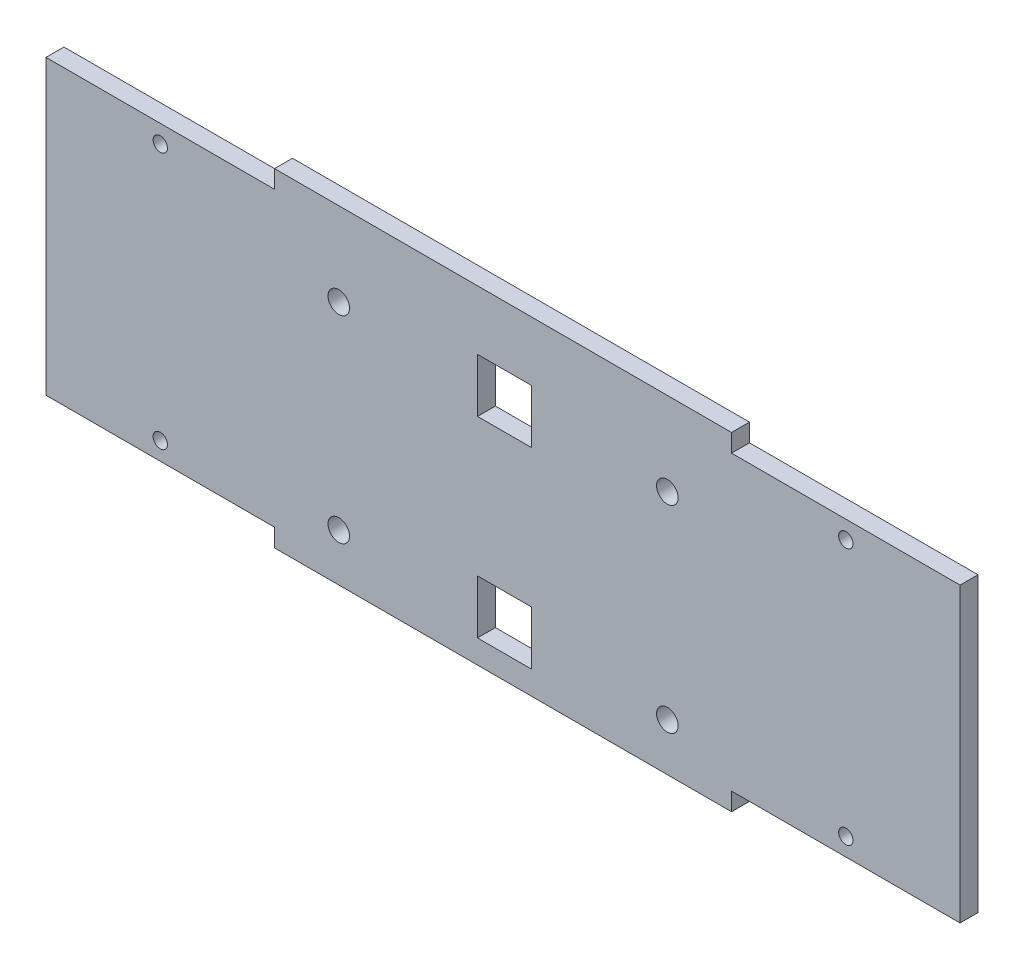
ISO-10303-21;
HEADER;
FILE_DESCRIPTION(('STEP AP214'),'2;1');
FILE_NAME('part.step','',(''),(''),'','','');
FILE_SCHEMA(('AUTOMOTIVE_DESIGN { 1 0 10303 214 1 1 1 1 }'));
ENDSEC;
DATA;
#1=APPLICATION_CONTEXT('core data for automotive mechanical design processes');
#2=APPLICATION_PROTOCOL_DEFINITION('international standard','automotive_design',2000,#1);
#3=PRODUCT_CONTEXT('',#1,'mechanical');
#4=PRODUCT('Part','Part','',(#3));
#5=PRODUCT_RELATED_PRODUCT_CATEGORY('part','',(#4));
#6=PRODUCT_DEFINITION_FORMATION('','',#4);
#7=PRODUCT_DEFINITION_CONTEXT('part definition',#1,'design');
#8=PRODUCT_DEFINITION('design','',#6,#7);
#9=PRODUCT_DEFINITION_SHAPE('','',#8);
#10=(LENGTH_UNIT() NAMED_UNIT(*) SI_UNIT(.MILLI.,.METRE.));
#11=(NAMED_UNIT(*) PLANE_ANGLE_UNIT() SI_UNIT($,.RADIAN.));
#12=(NAMED_UNIT(*) SI_UNIT($,.STERADIAN.) SOLID_ANGLE_UNIT());
#13=UNCERTAINTY_MEASURE_WITH_UNIT(LENGTH_MEASURE(1.E-05),#10,'distance_accuracy_value','');
#14=(GEOMETRIC_REPRESENTATION_CONTEXT(3) GLOBAL_UNCERTAINTY_ASSIGNED_CONTEXT((#13)) GLOBAL_UNIT_ASSIGNED_CONTEXT((#10,
#11,#12)) REPRESENTATION_CONTEXT('',''));
#15=CARTESIAN_POINT('',(0.,0.,0.));
#16=DIRECTION('',(0.,0.,1.));
#17=DIRECTION('',(1.,0.,0.));
#18=AXIS2_PLACEMENT_3D('',#15,#16,#17);
#19=CARTESIAN_POINT('',(63.75,0.,5.));
#20=DIRECTION('',(-1.,0.,0.));
#21=DIRECTION('',(0.,0.,1.));
#22=AXIS2_PLACEMENT_3D('',#19,#20,#21);
#23=PLANE('',#22);
#24=DIRECTION('',(0.,1.,0.));
#25=VECTOR('',#24,1.);
#26=CARTESIAN_POINT('',(63.75,0.,0.));
#27=LINE('',#26,#25);
#28=CARTESIAN_POINT('',(63.75,81.6376455792225,0.));
#29=VERTEX_POINT('',#28);
#30=CARTESIAN_POINT('',(63.75,86.6376455792225,0.));
#31=VERTEX_POINT('',#30);
#32=EDGE_CURVE('E205',#29,#31,#27,.T.);
#33=ORIENTED_EDGE('',*,*,#32,.F.);
#34=DIRECTION('',(0.,0.,-1.));
#35=VECTOR('',#34,1.);
#36=CARTESIAN_POINT('',(63.75,81.6376455792225,0.));
#37=LINE('',#36,#35);
#38=CARTESIAN_POINT('',(63.75,81.6376455792225,5.));
#39=VERTEX_POINT('',#38);
#40=EDGE_CURVE('E428',#39,#29,#37,.T.);
#41=ORIENTED_EDGE('',*,*,#40,.F.);
#42=DIRECTION('',(0.,1.,0.));
#43=VECTOR('',#42,1.);
#44=CARTESIAN_POINT('',(63.75,0.,5.));
#45=LINE('',#44,#43);
#46=CARTESIAN_POINT('',(63.75,86.6376455792225,5.));
#47=VERTEX_POINT('',#46);
#48=EDGE_CURVE('E398',#39,#47,#45,.T.);
#49=ORIENTED_EDGE('',*,*,#48,.T.);
#50=DIRECTION('',(0.,0.,1.));
#51=VECTOR('',#50,1.);
#52=CARTESIAN_POINT('',(63.75,86.6376455792225,0.));
#53=LINE('',#52,#51);
#54=EDGE_CURVE('E437',#31,#47,#53,.T.);
#55=ORIENTED_EDGE('',*,*,#54,.F.);
#56=EDGE_LOOP('',(#33,#41,#49,#55));
#57=FACE_BOUND('',#56,.T.);
#58=ADVANCED_FACE('F35',(#57),#23,.T.);
#59=CARTESIAN_POINT('',(0.,0.,5.));
#60=DIRECTION('',(0.,0.,1.));
#61=DIRECTION('',(1.,0.,0.));
#62=AXIS2_PLACEMENT_3D('',#59,#60,#61);
#63=PLANE('',#62);
#64=CARTESIAN_POINT('',(223.125,76.6376455792225,5.));
#65=DIRECTION('',(0.,0.,1.));
#66=DIRECTION('',(1.,0.,0.));
#67=AXIS2_PLACEMENT_3D('',#64,#65,#66);
#68=CIRCLE('',#67,2.);
#69=CARTESIAN_POINT('',(225.125,76.6376455792225,5.));
#70=VERTEX_POINT('',#69);
#71=EDGE_CURVE('E534',#70,#70,#68,.T.);
#72=ORIENTED_EDGE('',*,*,#71,.F.);
#73=EDGE_LOOP('',(#72));
#74=FACE_BOUND('',#73,.T.);
#75=CARTESIAN_POINT('',(31.875,76.6376455792225,5.));
#76=DIRECTION('',(0.,0.,1.));
#77=DIRECTION('',(1.,0.,0.));
#78=AXIS2_PLACEMENT_3D('',#75,#76,#77);
#79=CIRCLE('',#78,2.);
#80=CARTESIAN_POINT('',(33.875,76.6376455792225,5.));
#81=VERTEX_POINT('',#80);
#82=EDGE_CURVE('E537',#81,#81,#79,.T.);
#83=ORIENTED_EDGE('',*,*,#82,.F.);
#84=EDGE_LOOP('',(#83));
#85=FACE_BOUND('',#84,.T.);
#86=ORIENTED_EDGE('',*,*,#48,.F.);
#87=DIRECTION('',(1.,0.,0.));
#88=VECTOR('',#87,1.);
#89=CARTESIAN_POINT('',(63.75,81.6376455792225,5.));
#90=LINE('',#89,#88);
#91=CARTESIAN_POINT('',(0.,81.6376455792225,5.));
#92=VERTEX_POINT('',#91);
#93=EDGE_CURVE('E412',#92,#39,#90,.T.);
#94=ORIENTED_EDGE('',*,*,#93,.F.);
#95=DIRECTION('',(0.,1.,0.));
#96=VECTOR('',#95,1.);
#97=CARTESIAN_POINT('',(0.,0.,5.));
#98=LINE('',#97,#96);
#99=CARTESIAN_POINT('',(0.,0.,5.));
#100=VERTEX_POINT('',#99);
#101=EDGE_CURVE('E401',#100,#92,#98,.T.);
#102=ORIENTED_EDGE('',*,*,#101,.F.);
#103=DIRECTION('',(1.,0.,0.));
#104=VECTOR('',#103,1.);
#105=CARTESIAN_POINT('',(0.,0.,5.));
#106=LINE('',#105,#104);
#107=CARTESIAN_POINT('',(63.75,0.,5.));
#108=VERTEX_POINT('',#107);
#109=EDGE_CURVE('E404',#100,#108,#106,.T.);
#110=ORIENTED_EDGE('',*,*,#109,.T.);
#111=DIRECTION('',(0.,-1.,0.));
#112=VECTOR('',#111,1.);
#113=CARTESIAN_POINT('',(63.75,0.,5.));
#114=LINE('',#113,#112);
#115=CARTESIAN_POINT('',(63.75,-5.,5.));
#116=VERTEX_POINT('',#115);
#117=EDGE_CURVE('E376',#108,#116,#114,.T.);
#118=ORIENTED_EDGE('',*,*,#117,.T.);
#119=DIRECTION('',(1.,0.,0.));
#120=VECTOR('',#119,1.);
#121=CARTESIAN_POINT('',(0.,-5.,5.));
#122=LINE('',#121,#120);
#123=CARTESIAN_POINT('',(191.25,-5.,5.));
#124=VERTEX_POINT('',#123);
#125=EDGE_CURVE('E384',#116,#124,#122,.T.);
#126=ORIENTED_EDGE('',*,*,#125,.T.);
#127=DIRECTION('',(0.,1.,0.));
#128=VECTOR('',#127,1.);
#129=CARTESIAN_POINT('',(191.25,0.,5.));
#130=LINE('',#129,#128);
#131=CARTESIAN_POINT('',(191.25,0.,5.));
#132=VERTEX_POINT('',#131);
#133=EDGE_CURVE('E386',#124,#132,#130,.T.);
#134=ORIENTED_EDGE('',*,*,#133,.T.);
#135=DIRECTION('',(1.,0.,0.));
#136=VECTOR('',#135,1.);
#137=CARTESIAN_POINT('',(0.,0.,5.));
#138=LINE('',#137,#136);
#139=CARTESIAN_POINT('',(255.,0.,5.));
#140=VERTEX_POINT('',#139);
#141=EDGE_CURVE('E388',#132,#140,#138,.T.);
#142=ORIENTED_EDGE('',*,*,#141,.T.);
#143=DIRECTION('',(0.,1.,0.));
#144=VECTOR('',#143,1.);
#145=CARTESIAN_POINT('',(255.,0.,5.));
#146=LINE('',#145,#144);
#147=CARTESIAN_POINT('',(255.,81.6376455792225,5.));
#148=VERTEX_POINT('',#147);
#149=EDGE_CURVE('E395',#140,#148,#146,.T.);
#150=ORIENTED_EDGE('',*,*,#149,.T.);
#151=DIRECTION('',(1.,0.,0.));
#152=VECTOR('',#151,1.);
#153=CARTESIAN_POINT('',(255.,81.6376455792225,5.));
#154=LINE('',#153,#152);
#155=CARTESIAN_POINT('',(191.25,81.6376455792225,5.));
#156=VERTEX_POINT('',#155);
#157=EDGE_CURVE('E458',#156,#148,#154,.T.);
#158=ORIENTED_EDGE('',*,*,#157,.F.);
#159=DIRECTION('',(0.,-1.,0.));
#160=VECTOR('',#159,1.);
#161=CARTESIAN_POINT('',(191.25,86.6376455792225,5.));
#162=LINE('',#161,#160);
#163=CARTESIAN_POINT('',(191.25,86.6376455792225,5.));
#164=VERTEX_POINT('',#163);
#165=EDGE_CURVE('E443',#164,#156,#162,.T.);
#166=ORIENTED_EDGE('',*,*,#165,.F.);
#167=DIRECTION('',(1.,0.,0.));
#168=VECTOR('',#167,1.);
#169=CARTESIAN_POINT('',(191.25,86.6376455792225,5.));
#170=LINE('',#169,#168);
#171=EDGE_CURVE('E440',#47,#164,#170,.T.);
#172=ORIENTED_EDGE('',*,*,#171,.F.);
#173=EDGE_LOOP('',(#86,#94,#102,#110,#118,#126,#134,#142,#150,#158,#166,#172));
#174=FACE_BOUND('',#173,.T.);
#175=CARTESIAN_POINT('',(223.125,4.99999999999999,5.));
#176=DIRECTION('',(0.,0.,1.));
#177=DIRECTION('',(1.,0.,0.));
#178=AXIS2_PLACEMENT_3D('',#175,#176,#177);
#179=CIRCLE('',#178,2.);
#180=CARTESIAN_POINT('',(225.125,4.99999999999999,5.));
#181=VERTEX_POINT('',#180);
#182=EDGE_CURVE('E174',#181,#181,#179,.T.);
#183=ORIENTED_EDGE('',*,*,#182,.F.);
#184=EDGE_LOOP('',(#183));
#185=FACE_BOUND('',#184,.T.);
#186=CARTESIAN_POINT('',(31.875,4.99999999999999,5.));
#187=DIRECTION('',(0.,0.,1.));
#188=DIRECTION('',(1.,0.,0.));
#189=AXIS2_PLACEMENT_3D('',#186,#187,#188);
#190=CIRCLE('',#189,2.);
#191=CARTESIAN_POINT('',(33.875,4.99999999999999,5.));
#192=VERTEX_POINT('',#191);
#193=EDGE_CURVE('E467',#192,#192,#190,.T.);
#194=ORIENTED_EDGE('',*,*,#193,.F.);
#195=EDGE_LOOP('',(#194));
#196=FACE_BOUND('',#195,.T.);
#197=CARTESIAN_POINT('',(173.3315727,8.27911762961123,5.));
#198=DIRECTION('',(0.,0.,1.));
#199=DIRECTION('',(1.,0.,0.));
#200=AXIS2_PLACEMENT_3D('',#197,#198,#199);
#201=CIRCLE('',#200,2.99999999999999);
#202=CARTESIAN_POINT('',(176.3315727,8.27911762961123,5.));
#203=VERTEX_POINT('',#202);
#204=EDGE_CURVE('E223',#203,#203,#201,.T.);
#205=ORIENTED_EDGE('',*,*,#204,.F.);
#206=EDGE_LOOP('',(#205));
#207=FACE_BOUND('',#206,.T.);
#208=CARTESIAN_POINT('',(81.6684273,8.27911762961123,5.));
#209=DIRECTION('',(0.,0.,1.));
#210=DIRECTION('',(1.,0.,0.));
#211=AXIS2_PLACEMENT_3D('',#208,#209,#210);
#212=CIRCLE('',#211,3.00000000000001);
#213=CARTESIAN_POINT('',(84.6684273,8.27911762961123,5.));
#214=VERTEX_POINT('',#213);
#215=EDGE_CURVE('E335',#214,#214,#212,.T.);
#216=ORIENTED_EDGE('',*,*,#215,.F.);
#217=EDGE_LOOP('',(#216));
#218=FACE_BOUND('',#217,.T.);
#219=CARTESIAN_POINT('',(173.3315727,63.3585279496113,5.));
#220=DIRECTION('',(0.,0.,1.));
#221=DIRECTION('',(1.,0.,0.));
#222=AXIS2_PLACEMENT_3D('',#219,#220,#221);
#223=CIRCLE('',#222,2.99999999999999);
#224=CARTESIAN_POINT('',(176.3315727,63.3585279496113,5.));
#225=VERTEX_POINT('',#224);
#226=EDGE_CURVE('E475',#225,#225,#223,.T.);
#227=ORIENTED_EDGE('',*,*,#226,.F.);
#228=EDGE_LOOP('',(#227));
#229=FACE_BOUND('',#228,.T.);
#230=CARTESIAN_POINT('',(81.6684273,63.3585279496113,5.));
#231=DIRECTION('',(0.,0.,1.));
#232=DIRECTION('',(1.,0.,0.));
#233=AXIS2_PLACEMENT_3D('',#230,#231,#232);
#234=CIRCLE('',#233,3.00000000000001);
#235=CARTESIAN_POINT('',(84.6684273,63.3585279496113,5.));
#236=VERTEX_POINT('',#235);
#237=EDGE_CURVE('E478',#236,#236,#234,.T.);
#238=ORIENTED_EDGE('',*,*,#237,.F.);
#239=EDGE_LOOP('',(#238));
#240=FACE_BOUND('',#239,.T.);
#241=DIRECTION('',(-1.,0.,0.));
#242=VECTOR('',#241,1.);
#243=CARTESIAN_POINT('',(0.,16.5582352592225,5.));
#244=LINE('',#243,#242);
#245=CARTESIAN_POINT('',(135.370410972912,16.5582352592223,5.));
#246=VERTEX_POINT('',#245);
#247=CARTESIAN_POINT('',(120.370410972912,16.5582352592223,5.));
#248=VERTEX_POINT('',#247);
#249=EDGE_CURVE('E260',#246,#248,#244,.T.);
#250=ORIENTED_EDGE('',*,*,#249,.F.);
#251=DIRECTION('',(0.,-1.,0.));
#252=VECTOR('',#251,1.);
#253=CARTESIAN_POINT('',(135.370410972912,0.,5.));
#254=LINE('',#253,#252);
#255=CARTESIAN_POINT('',(135.370410972912,1.5582352592223,5.));
#256=VERTEX_POINT('',#255);
#257=EDGE_CURVE('E253',#246,#256,#254,.T.);
#258=ORIENTED_EDGE('',*,*,#257,.T.);
#259=DIRECTION('',(-1.,0.,0.));
#260=VECTOR('',#259,1.);
#261=CARTESIAN_POINT('',(0.,1.55823525922255,5.));
#262=LINE('',#261,#260);
#263=CARTESIAN_POINT('',(120.370410972912,1.55823525922233,5.));
#264=VERTEX_POINT('',#263);
#265=EDGE_CURVE('E390',#256,#264,#262,.T.);
#266=ORIENTED_EDGE('',*,*,#265,.T.);
#267=DIRECTION('',(0.,-1.,0.));
#268=VECTOR('',#267,1.);
#269=CARTESIAN_POINT('',(120.370410972912,-2.22730002909532E-13,5.));
#270=LINE('',#269,#268);
#271=EDGE_CURVE('E265',#248,#264,#270,.T.);
#272=ORIENTED_EDGE('',*,*,#271,.F.);
#273=EDGE_LOOP('',(#250,#258,#266,#272));
#274=FACE_BOUND('',#273,.T.);
#275=DIRECTION('',(-1.,0.,0.));
#276=VECTOR('',#275,1.);
#277=CARTESIAN_POINT('',(0.,55.07941032,5.));
#278=LINE('',#277,#276);
#279=CARTESIAN_POINT('',(135.370410972912,55.07941032,5.));
#280=VERTEX_POINT('',#279);
#281=CARTESIAN_POINT('',(120.370410972912,55.07941032,5.));
#282=VERTEX_POINT('',#281);
#283=EDGE_CURVE('E153',#280,#282,#278,.T.);
#284=ORIENTED_EDGE('',*,*,#283,.T.);
#285=DIRECTION('',(0.,1.,0.));
#286=VECTOR('',#285,1.);
#287=CARTESIAN_POINT('',(120.370410972912,0.,5.));
#288=LINE('',#287,#286);
#289=CARTESIAN_POINT('',(120.370410972912,70.07941032,5.));
#290=VERTEX_POINT('',#289);
#291=EDGE_CURVE('E147',#282,#290,#288,.T.);
#292=ORIENTED_EDGE('',*,*,#291,.T.);
#293=DIRECTION('',(-1.,0.,0.));
#294=VECTOR('',#293,1.);
#295=CARTESIAN_POINT('',(0.,70.07941032,5.));
#296=LINE('',#295,#294);
#297=CARTESIAN_POINT('',(135.370410972912,70.07941032,5.));
#298=VERTEX_POINT('',#297);
#299=EDGE_CURVE('E152',#298,#290,#296,.T.);
#300=ORIENTED_EDGE('',*,*,#299,.F.);
#301=DIRECTION('',(0.,1.,0.));
#302=VECTOR('',#301,1.);
#303=CARTESIAN_POINT('',(135.370410972912,0.,5.));
#304=LINE('',#303,#302);
#305=EDGE_CURVE('E164',#280,#298,#304,.T.);
#306=ORIENTED_EDGE('',*,*,#305,.F.);
#307=EDGE_LOOP('',(#284,#292,#300,#306));
#308=FACE_BOUND('',#307,.T.);
#309=ADVANCED_FACE('F149',(#74,#85,#174,#185,#196,#207,#218,#229,#240,#274,#308),#63,.T.);
#310=CARTESIAN_POINT('',(0.,0.,0.));
#311=DIRECTION('',(0.,0.,1.));
#312=DIRECTION('',(1.,0.,0.));
#313=AXIS2_PLACEMENT_3D('',#310,#311,#312);
#314=PLANE('',#313);
#315=CARTESIAN_POINT('',(223.125,76.6376455792225,0.));
#316=DIRECTION('',(0.,0.,-1.));
#317=DIRECTION('',(-1.,0.,0.));
#318=AXIS2_PLACEMENT_3D('',#315,#316,#317);
#319=CIRCLE('',#318,2.);
#320=CARTESIAN_POINT('',(221.125,76.6376455792225,0.));
#321=VERTEX_POINT('',#320);
#322=EDGE_CURVE('E536',#321,#321,#319,.T.);
#323=ORIENTED_EDGE('',*,*,#322,.F.);
#324=EDGE_LOOP('',(#323));
#325=FACE_BOUND('',#324,.T.);
#326=CARTESIAN_POINT('',(31.875,76.6376455792225,0.));
#327=DIRECTION('',(0.,0.,-1.));
#328=DIRECTION('',(-1.,0.,0.));
#329=AXIS2_PLACEMENT_3D('',#326,#327,#328);
#330=CIRCLE('',#329,2.);
#331=CARTESIAN_POINT('',(29.875,76.6376455792225,0.));
#332=VERTEX_POINT('',#331);
#333=EDGE_CURVE('E538',#332,#332,#330,.T.);
#334=ORIENTED_EDGE('',*,*,#333,.F.);
#335=EDGE_LOOP('',(#334));
#336=FACE_BOUND('',#335,.T.);
#337=DIRECTION('',(-1.,0.,0.));
#338=VECTOR('',#337,1.);
#339=CARTESIAN_POINT('',(63.75,81.6376455792225,0.));
#340=LINE('',#339,#338);
#341=CARTESIAN_POINT('',(0.,81.6376455792225,0.));
#342=VERTEX_POINT('',#341);
#343=EDGE_CURVE('E424',#29,#342,#340,.T.);
#344=ORIENTED_EDGE('',*,*,#343,.F.);
#345=ORIENTED_EDGE('',*,*,#32,.T.);
#346=DIRECTION('',(-1.,0.,0.));
#347=VECTOR('',#346,1.);
#348=CARTESIAN_POINT('',(191.25,86.6376455792225,0.));
#349=LINE('',#348,#347);
#350=CARTESIAN_POINT('',(191.25,86.6376455792225,0.));
#351=VERTEX_POINT('',#350);
#352=EDGE_CURVE('E434',#351,#31,#349,.T.);
#353=ORIENTED_EDGE('',*,*,#352,.F.);
#354=DIRECTION('',(0.,-1.,0.));
#355=VECTOR('',#354,1.);
#356=CARTESIAN_POINT('',(191.25,86.6376455792225,0.));
#357=LINE('',#356,#355);
#358=CARTESIAN_POINT('',(191.25,81.6376455792225,0.));
#359=VERTEX_POINT('',#358);
#360=EDGE_CURVE('E446',#351,#359,#357,.T.);
#361=ORIENTED_EDGE('',*,*,#360,.T.);
#362=DIRECTION('',(-1.,0.,0.));
#363=VECTOR('',#362,1.);
#364=CARTESIAN_POINT('',(255.,81.6376455792225,0.));
#365=LINE('',#364,#363);
#366=CARTESIAN_POINT('',(255.,81.6376455792225,0.));
#367=VERTEX_POINT('',#366);
#368=EDGE_CURVE('E452',#367,#359,#365,.T.);
#369=ORIENTED_EDGE('',*,*,#368,.F.);
#370=DIRECTION('',(0.,1.,0.));
#371=VECTOR('',#370,1.);
#372=CARTESIAN_POINT('',(255.,0.,0.));
#373=LINE('',#372,#371);
#374=CARTESIAN_POINT('',(255.,0.,0.));
#375=VERTEX_POINT('',#374);
#376=EDGE_CURVE('E202',#375,#367,#373,.T.);
#377=ORIENTED_EDGE('',*,*,#376,.F.);
#378=DIRECTION('',(1.,0.,0.));
#379=VECTOR('',#378,1.);
#380=CARTESIAN_POINT('',(0.,0.,0.));
#381=LINE('',#380,#379);
#382=CARTESIAN_POINT('',(191.25,0.,0.));
#383=VERTEX_POINT('',#382);
#384=EDGE_CURVE('E200',#383,#375,#381,.T.);
#385=ORIENTED_EDGE('',*,*,#384,.F.);
#386=DIRECTION('',(0.,1.,0.));
#387=VECTOR('',#386,1.);
#388=CARTESIAN_POINT('',(191.25,0.,0.));
#389=LINE('',#388,#387);
#390=CARTESIAN_POINT('',(191.25,-5.,0.));
#391=VERTEX_POINT('',#390);
#392=EDGE_CURVE('E198',#391,#383,#389,.T.);
#393=ORIENTED_EDGE('',*,*,#392,.F.);
#394=DIRECTION('',(1.,0.,0.));
#395=VECTOR('',#394,1.);
#396=CARTESIAN_POINT('',(0.,-5.,0.));
#397=LINE('',#396,#395);
#398=CARTESIAN_POINT('',(63.75,-5.,0.));
#399=VERTEX_POINT('',#398);
#400=EDGE_CURVE('E195',#399,#391,#397,.T.);
#401=ORIENTED_EDGE('',*,*,#400,.F.);
#402=DIRECTION('',(0.,-1.,0.));
#403=VECTOR('',#402,1.);
#404=CARTESIAN_POINT('',(63.75,0.,0.));
#405=LINE('',#404,#403);
#406=CARTESIAN_POINT('',(63.75,0.,0.));
#407=VERTEX_POINT('',#406);
#408=EDGE_CURVE('E213',#407,#399,#405,.T.);
#409=ORIENTED_EDGE('',*,*,#408,.F.);
#410=DIRECTION('',(1.,0.,0.));
#411=VECTOR('',#410,1.);
#412=CARTESIAN_POINT('',(0.,0.,0.));
#413=LINE('',#412,#411);
#414=CARTESIAN_POINT('',(0.,0.,0.));
#415=VERTEX_POINT('',#414);
#416=EDGE_CURVE('E211',#415,#407,#413,.T.);
#417=ORIENTED_EDGE('',*,*,#416,.F.);
#418=DIRECTION('',(0.,1.,0.));
#419=VECTOR('',#418,1.);
#420=CARTESIAN_POINT('',(0.,0.,0.));
#421=LINE('',#420,#419);
#422=EDGE_CURVE('E208',#415,#342,#421,.T.);
#423=ORIENTED_EDGE('',*,*,#422,.T.);
#424=EDGE_LOOP('',(#344,#345,#353,#361,#369,#377,#385,#393,#401,#409,#417,#423));
#425=FACE_BOUND('',#424,.T.);
#426=CARTESIAN_POINT('',(223.125,4.99999999999999,0.));
#427=DIRECTION('',(0.,0.,-1.));
#428=DIRECTION('',(-1.,0.,0.));
#429=AXIS2_PLACEMENT_3D('',#426,#427,#428);
#430=CIRCLE('',#429,2.);
#431=CARTESIAN_POINT('',(221.125,4.99999999999999,0.));
#432=VERTEX_POINT('',#431);
#433=EDGE_CURVE('E461',#432,#432,#430,.T.);
#434=ORIENTED_EDGE('',*,*,#433,.F.);
#435=EDGE_LOOP('',(#434));
#436=FACE_BOUND('',#435,.T.);
#437=CARTESIAN_POINT('',(31.875,4.99999999999999,0.));
#438=DIRECTION('',(0.,0.,-1.));
#439=DIRECTION('',(-1.,0.,0.));
#440=AXIS2_PLACEMENT_3D('',#437,#438,#439);
#441=CIRCLE('',#440,2.);
#442=CARTESIAN_POINT('',(29.875,4.99999999999999,0.));
#443=VERTEX_POINT('',#442);
#444=EDGE_CURVE('E464',#443,#443,#441,.T.);
#445=ORIENTED_EDGE('',*,*,#444,.F.);
#446=EDGE_LOOP('',(#445));
#447=FACE_BOUND('',#446,.T.);
#448=CARTESIAN_POINT('',(173.3315727,8.27911762961123,0.));
#449=DIRECTION('',(0.,0.,1.));
#450=DIRECTION('',(1.,0.,0.));
#451=AXIS2_PLACEMENT_3D('',#448,#449,#450);
#452=CIRCLE('',#451,2.99999999999999);
#453=CARTESIAN_POINT('',(176.3315727,8.27911762961123,0.));
#454=VERTEX_POINT('',#453);
#455=EDGE_CURVE('E170',#454,#454,#452,.T.);
#456=ORIENTED_EDGE('',*,*,#455,.T.);
#457=EDGE_LOOP('',(#456));
#458=FACE_BOUND('',#457,.T.);
#459=CARTESIAN_POINT('',(81.6684273,8.27911762961123,0.));
#460=DIRECTION('',(0.,0.,1.));
#461=DIRECTION('',(1.,0.,0.));
#462=AXIS2_PLACEMENT_3D('',#459,#460,#461);
#463=CIRCLE('',#462,3.00000000000001);
#464=CARTESIAN_POINT('',(84.6684273,8.27911762961123,0.));
#465=VERTEX_POINT('',#464);
#466=EDGE_CURVE('E173',#465,#465,#463,.T.);
#467=ORIENTED_EDGE('',*,*,#466,.T.);
#468=EDGE_LOOP('',(#467));
#469=FACE_BOUND('',#468,.T.);
#470=CARTESIAN_POINT('',(173.3315727,63.3585279496113,0.));
#471=DIRECTION('',(0.,0.,1.));
#472=DIRECTION('',(1.,0.,0.));
#473=AXIS2_PLACEMENT_3D('',#470,#471,#472);
#474=CIRCLE('',#473,2.99999999999999);
#475=CARTESIAN_POINT('',(176.3315727,63.3585279496113,0.));
#476=VERTEX_POINT('',#475);
#477=EDGE_CURVE('E177',#476,#476,#474,.T.);
#478=ORIENTED_EDGE('',*,*,#477,.T.);
#479=EDGE_LOOP('',(#478));
#480=FACE_BOUND('',#479,.T.);
#481=CARTESIAN_POINT('',(81.6684273,63.3585279496113,0.));
#482=DIRECTION('',(0.,0.,1.));
#483=DIRECTION('',(1.,0.,0.));
#484=AXIS2_PLACEMENT_3D('',#481,#482,#483);
#485=CIRCLE('',#484,3.00000000000001);
#486=CARTESIAN_POINT('',(84.6684273,63.3585279496113,0.));
#487=VERTEX_POINT('',#486);
#488=EDGE_CURVE('E180',#487,#487,#485,.T.);
#489=ORIENTED_EDGE('',*,*,#488,.T.);
#490=EDGE_LOOP('',(#489));
#491=FACE_BOUND('',#490,.T.);
#492=DIRECTION('',(-1.,0.,0.));
#493=VECTOR('',#492,1.);
#494=CARTESIAN_POINT('',(0.,16.5582352592225,0.));
#495=LINE('',#494,#493);
#496=CARTESIAN_POINT('',(135.370410972912,16.5582352592223,0.));
#497=VERTEX_POINT('',#496);
#498=CARTESIAN_POINT('',(120.370410972912,16.5582352592223,0.));
#499=VERTEX_POINT('',#498);
#500=EDGE_CURVE('E183',#497,#499,#495,.T.);
#501=ORIENTED_EDGE('',*,*,#500,.T.);
#502=DIRECTION('',(0.,-1.,0.));
#503=VECTOR('',#502,1.);
#504=CARTESIAN_POINT('',(120.370410972912,-2.22730002909532E-13,0.));
#505=LINE('',#504,#503);
#506=CARTESIAN_POINT('',(120.370410972912,1.55823525922233,0.));
#507=VERTEX_POINT('',#506);
#508=EDGE_CURVE('E192',#499,#507,#505,.T.);
#509=ORIENTED_EDGE('',*,*,#508,.T.);
#510=DIRECTION('',(-1.,0.,0.));
#511=VECTOR('',#510,1.);
#512=CARTESIAN_POINT('',(0.,1.55823525922255,0.));
#513=LINE('',#512,#511);
#514=CARTESIAN_POINT('',(135.370410972912,1.5582352592223,0.));
#515=VERTEX_POINT('',#514);
#516=EDGE_CURVE('E189',#515,#507,#513,.T.);
#517=ORIENTED_EDGE('',*,*,#516,.F.);
#518=DIRECTION('',(0.,-1.,0.));
#519=VECTOR('',#518,1.);
#520=CARTESIAN_POINT('',(135.370410972912,0.,0.));
#521=LINE('',#520,#519);
#522=EDGE_CURVE('E186',#497,#515,#521,.T.);
#523=ORIENTED_EDGE('',*,*,#522,.F.);
#524=EDGE_LOOP('',(#501,#509,#517,#523));
#525=FACE_BOUND('',#524,.T.);
#526=DIRECTION('',(-1.,0.,0.));
#527=VECTOR('',#526,1.);
#528=CARTESIAN_POINT('',(0.,55.07941032,0.));
#529=LINE('',#528,#527);
#530=CARTESIAN_POINT('',(135.370410972912,55.07941032,0.));
#531=VERTEX_POINT('',#530);
#532=CARTESIAN_POINT('',(120.370410972912,55.07941032,0.));
#533=VERTEX_POINT('',#532);
#534=EDGE_CURVE('E215',#531,#533,#529,.T.);
#535=ORIENTED_EDGE('',*,*,#534,.F.);
#536=DIRECTION('',(0.,1.,0.));
#537=VECTOR('',#536,1.);
#538=CARTESIAN_POINT('',(135.370410972912,0.,0.));
#539=LINE('',#538,#537);
#540=CARTESIAN_POINT('',(135.370410972912,70.07941032,0.));
#541=VERTEX_POINT('',#540);
#542=EDGE_CURVE('E220',#531,#541,#539,.T.);
#543=ORIENTED_EDGE('',*,*,#542,.T.);
#544=DIRECTION('',(-1.,0.,0.));
#545=VECTOR('',#544,1.);
#546=CARTESIAN_POINT('',(0.,70.07941032,0.));
#547=LINE('',#546,#545);
#548=CARTESIAN_POINT('',(120.370410972912,70.07941032,0.));
#549=VERTEX_POINT('',#548);
#550=EDGE_CURVE('E218',#541,#549,#547,.T.);
#551=ORIENTED_EDGE('',*,*,#550,.T.);
#552=DIRECTION('',(0.,1.,0.));
#553=VECTOR('',#552,1.);
#554=CARTESIAN_POINT('',(120.370410972912,0.,0.));
#555=LINE('',#554,#553);
#556=EDGE_CURVE('E159',#533,#549,#555,.T.);
#557=ORIENTED_EDGE('',*,*,#556,.F.);
#558=EDGE_LOOP('',(#535,#543,#551,#557));
#559=FACE_BOUND('',#558,.T.);
#560=ADVANCED_FACE('F256',(#325,#336,#425,#436,#447,#458,#469,#480,#491,#525,#559),#314,.F.);
#561=CARTESIAN_POINT('',(0.,55.07941032,5.));
#562=DIRECTION('',(0.,-1.,0.));
#563=DIRECTION('',(0.,0.,-1.));
#564=AXIS2_PLACEMENT_3D('',#561,#562,#563);
#565=PLANE('',#564);
#566=ORIENTED_EDGE('',*,*,#534,.T.);
#567=DIRECTION('',(0.,0.,-1.));
#568=VECTOR('',#567,1.);
#569=CARTESIAN_POINT('',(120.370410972912,55.07941032,5.));
#570=LINE('',#569,#568);
#571=EDGE_CURVE('E11',#282,#533,#570,.T.);
#572=ORIENTED_EDGE('',*,*,#571,.F.);
#573=ORIENTED_EDGE('',*,*,#283,.F.);
#574=DIRECTION('',(0.,0.,-1.));
#575=VECTOR('',#574,1.);
#576=CARTESIAN_POINT('',(135.370410972912,55.07941032,5.));
#577=LINE('',#576,#575);
#578=EDGE_CURVE('E54',#280,#531,#577,.T.);
#579=ORIENTED_EDGE('',*,*,#578,.T.);
#580=EDGE_LOOP('',(#566,#572,#573,#579));
#581=FACE_BOUND('',#580,.T.);
#582=ADVANCED_FACE('F340',(#581),#565,.F.);
#583=CARTESIAN_POINT('',(120.370410972912,0.,5.));
#584=DIRECTION('',(-1.,0.,0.));
#585=DIRECTION('',(0.,0.,1.));
#586=AXIS2_PLACEMENT_3D('',#583,#584,#585);
#587=PLANE('',#586);
#588=ORIENTED_EDGE('',*,*,#556,.T.);
#589=DIRECTION('',(0.,0.,-1.));
#590=VECTOR('',#589,1.);
#591=CARTESIAN_POINT('',(120.370410972912,70.07941032,5.));
#592=LINE('',#591,#590);
#593=EDGE_CURVE('E45',#290,#549,#592,.T.);
#594=ORIENTED_EDGE('',*,*,#593,.F.);
#595=ORIENTED_EDGE('',*,*,#291,.F.);
#596=ORIENTED_EDGE('',*,*,#571,.T.);
#597=EDGE_LOOP('',(#588,#594,#595,#596));
#598=FACE_BOUND('',#597,.T.);
#599=ADVANCED_FACE('F158',(#598),#587,.F.);
#600=CARTESIAN_POINT('',(0.,70.07941032,5.));
#601=DIRECTION('',(0.,-1.,0.));
#602=DIRECTION('',(0.,0.,-1.));
#603=AXIS2_PLACEMENT_3D('',#600,#601,#602);
#604=PLANE('',#603);
#605=ORIENTED_EDGE('',*,*,#550,.F.);
#606=DIRECTION('',(0.,0.,-1.));
#607=VECTOR('',#606,1.);
#608=CARTESIAN_POINT('',(135.370410972912,70.07941032,5.));
#609=LINE('',#608,#607);
#610=EDGE_CURVE('E99',#298,#541,#609,.T.);
#611=ORIENTED_EDGE('',*,*,#610,.F.);
#612=ORIENTED_EDGE('',*,*,#299,.T.);
#613=ORIENTED_EDGE('',*,*,#593,.T.);
#614=EDGE_LOOP('',(#605,#611,#612,#613));
#615=FACE_BOUND('',#614,.T.);
#616=ADVANCED_FACE('F163',(#615),#604,.T.);
#617=CARTESIAN_POINT('',(0.,-5.,5.));
#618=DIRECTION('',(0.,1.,0.));
#619=DIRECTION('',(0.,0.,1.));
#620=AXIS2_PLACEMENT_3D('',#617,#618,#619);
#621=PLANE('',#620);
#622=ORIENTED_EDGE('',*,*,#400,.T.);
#623=DIRECTION('',(0.,0.,-1.));
#624=VECTOR('',#623,1.);
#625=CARTESIAN_POINT('',(191.25,-5.,5.));
#626=LINE('',#625,#624);
#627=EDGE_CURVE('E225',#124,#391,#626,.T.);
#628=ORIENTED_EDGE('',*,*,#627,.F.);
#629=ORIENTED_EDGE('',*,*,#125,.F.);
#630=DIRECTION('',(0.,0.,-1.));
#631=VECTOR('',#630,1.);
#632=CARTESIAN_POINT('',(63.75,-5.,5.));
#633=LINE('',#632,#631);
#634=EDGE_CURVE('E227',#116,#399,#633,.T.);
#635=ORIENTED_EDGE('',*,*,#634,.T.);
#636=EDGE_LOOP('',(#622,#628,#629,#635));
#637=FACE_BOUND('',#636,.T.);
#638=ADVANCED_FACE('F304',(#637),#621,.F.);
#639=CARTESIAN_POINT('',(191.25,0.,5.));
#640=DIRECTION('',(-1.,0.,0.));
#641=DIRECTION('',(0.,0.,1.));
#642=AXIS2_PLACEMENT_3D('',#639,#640,#641);
#643=PLANE('',#642);
#644=ORIENTED_EDGE('',*,*,#392,.T.);
#645=DIRECTION('',(0.,0.,-1.));
#646=VECTOR('',#645,1.);
#647=CARTESIAN_POINT('',(191.25,0.,5.));
#648=LINE('',#647,#646);
#649=EDGE_CURVE('E238',#132,#383,#648,.T.);
#650=ORIENTED_EDGE('',*,*,#649,.F.);
#651=ORIENTED_EDGE('',*,*,#133,.F.);
#652=ORIENTED_EDGE('',*,*,#627,.T.);
#653=EDGE_LOOP('',(#644,#650,#651,#652));
#654=FACE_BOUND('',#653,.T.);
#655=ADVANCED_FACE('F300',(#654),#643,.F.);
#656=CARTESIAN_POINT('',(0.,0.,5.));
#657=DIRECTION('',(0.,1.,0.));
#658=DIRECTION('',(0.,0.,1.));
#659=AXIS2_PLACEMENT_3D('',#656,#657,#658);
#660=PLANE('',#659);
#661=ORIENTED_EDGE('',*,*,#384,.T.);
#662=DIRECTION('',(0.,0.,-1.));
#663=VECTOR('',#662,1.);
#664=CARTESIAN_POINT('',(255.,0.,5.));
#665=LINE('',#664,#663);
#666=EDGE_CURVE('E235',#140,#375,#665,.T.);
#667=ORIENTED_EDGE('',*,*,#666,.F.);
#668=ORIENTED_EDGE('',*,*,#141,.F.);
#669=ORIENTED_EDGE('',*,*,#649,.T.);
#670=EDGE_LOOP('',(#661,#667,#668,#669));
#671=FACE_BOUND('',#670,.T.);
#672=ADVANCED_FACE('F296',(#671),#660,.F.);
#673=CARTESIAN_POINT('',(255.,0.,5.));
#674=DIRECTION('',(-1.,0.,0.));
#675=DIRECTION('',(0.,0.,1.));
#676=AXIS2_PLACEMENT_3D('',#673,#674,#675);
#677=PLANE('',#676);
#678=ORIENTED_EDGE('',*,*,#376,.T.);
#679=DIRECTION('',(0.,0.,-1.));
#680=VECTOR('',#679,1.);
#681=CARTESIAN_POINT('',(255.,81.6376455792225,0.));
#682=LINE('',#681,#680);
#683=EDGE_CURVE('E449',#148,#367,#682,.T.);
#684=ORIENTED_EDGE('',*,*,#683,.F.);
#685=ORIENTED_EDGE('',*,*,#149,.F.);
#686=ORIENTED_EDGE('',*,*,#666,.T.);
#687=EDGE_LOOP('',(#678,#684,#685,#686));
#688=FACE_BOUND('',#687,.T.);
#689=ADVANCED_FACE('F293',(#688),#677,.F.);
#690=CARTESIAN_POINT('',(0.,0.,5.));
#691=DIRECTION('',(-1.,0.,0.));
#692=DIRECTION('',(0.,-1.,0.));
#693=AXIS2_PLACEMENT_3D('',#690,#691,#692);
#694=PLANE('',#693);
#695=ORIENTED_EDGE('',*,*,#422,.F.);
#696=DIRECTION('',(0.,0.,-1.));
#697=VECTOR('',#696,1.);
#698=CARTESIAN_POINT('',(0.,0.,5.));
#699=LINE('',#698,#697);
#700=EDGE_CURVE('E233',#100,#415,#699,.T.);
#701=ORIENTED_EDGE('',*,*,#700,.F.);
#702=ORIENTED_EDGE('',*,*,#101,.T.);
#703=DIRECTION('',(0.,0.,1.));
#704=VECTOR('',#703,1.);
#705=CARTESIAN_POINT('',(0.,81.6376455792225,0.));
#706=LINE('',#705,#704);
#707=EDGE_CURVE('E416',#342,#92,#706,.T.);
#708=ORIENTED_EDGE('',*,*,#707,.F.);
#709=EDGE_LOOP('',(#695,#701,#702,#708));
#710=FACE_BOUND('',#709,.T.);
#711=ADVANCED_FACE('F291',(#710),#694,.T.);
#712=CARTESIAN_POINT('',(0.,0.,5.));
#713=DIRECTION('',(0.,1.,0.));
#714=DIRECTION('',(0.,0.,1.));
#715=AXIS2_PLACEMENT_3D('',#712,#713,#714);
#716=PLANE('',#715);
#717=ORIENTED_EDGE('',*,*,#416,.T.);
#718=DIRECTION('',(0.,0.,-1.));
#719=VECTOR('',#718,1.);
#720=CARTESIAN_POINT('',(63.75,0.,5.));
#721=LINE('',#720,#719);
#722=EDGE_CURVE('E230',#108,#407,#721,.T.);
#723=ORIENTED_EDGE('',*,*,#722,.F.);
#724=ORIENTED_EDGE('',*,*,#109,.F.);
#725=ORIENTED_EDGE('',*,*,#700,.T.);
#726=EDGE_LOOP('',(#717,#723,#724,#725));
#727=FACE_BOUND('',#726,.T.);
#728=ADVANCED_FACE('F360',(#727),#716,.F.);
#729=CARTESIAN_POINT('',(0.,16.5582352592225,5.));
#730=DIRECTION('',(0.,-1.,0.));
#731=DIRECTION('',(1.,0.,0.));
#732=AXIS2_PLACEMENT_3D('',#729,#730,#731);
#733=PLANE('',#732);
#734=ORIENTED_EDGE('',*,*,#500,.F.);
#735=DIRECTION('',(0.,0.,-1.));
#736=VECTOR('',#735,1.);
#737=CARTESIAN_POINT('',(135.370410972912,16.5582352592223,5.));
#738=LINE('',#737,#736);
#739=EDGE_CURVE('E39',#246,#497,#738,.T.);
#740=ORIENTED_EDGE('',*,*,#739,.F.);
#741=ORIENTED_EDGE('',*,*,#249,.T.);
#742=DIRECTION('',(0.,0.,-1.));
#743=VECTOR('',#742,1.);
#744=CARTESIAN_POINT('',(120.370410972912,16.5582352592223,5.));
#745=LINE('',#744,#743);
#746=EDGE_CURVE('E166',#248,#499,#745,.T.);
#747=ORIENTED_EDGE('',*,*,#746,.T.);
#748=EDGE_LOOP('',(#734,#740,#741,#747));
#749=FACE_BOUND('',#748,.T.);
#750=ADVANCED_FACE('F259',(#749),#733,.T.);
#751=CARTESIAN_POINT('',(135.370410972912,0.,5.));
#752=DIRECTION('',(1.,0.,0.));
#753=DIRECTION('',(0.,0.,-1.));
#754=AXIS2_PLACEMENT_3D('',#751,#752,#753);
#755=PLANE('',#754);
#756=ORIENTED_EDGE('',*,*,#522,.T.);
#757=DIRECTION('',(0.,0.,-1.));
#758=VECTOR('',#757,1.);
#759=CARTESIAN_POINT('',(135.370410972912,1.5582352592223,5.));
#760=LINE('',#759,#758);
#761=EDGE_CURVE('E245',#256,#515,#760,.T.);
#762=ORIENTED_EDGE('',*,*,#761,.F.);
#763=ORIENTED_EDGE('',*,*,#257,.F.);
#764=ORIENTED_EDGE('',*,*,#739,.T.);
#765=EDGE_LOOP('',(#756,#762,#763,#764));
#766=FACE_BOUND('',#765,.T.);
#767=ADVANCED_FACE('F251',(#766),#755,.F.);
#768=CARTESIAN_POINT('',(0.,1.55823525922255,5.));
#769=DIRECTION('',(0.,-1.,0.));
#770=DIRECTION('',(1.,0.,0.));
#771=AXIS2_PLACEMENT_3D('',#768,#769,#770);
#772=PLANE('',#771);
#773=ORIENTED_EDGE('',*,*,#516,.T.);
#774=DIRECTION('',(0.,0.,-1.));
#775=VECTOR('',#774,1.);
#776=CARTESIAN_POINT('',(120.370410972912,1.55823525922233,5.));
#777=LINE('',#776,#775);
#778=EDGE_CURVE('E244',#264,#507,#777,.T.);
#779=ORIENTED_EDGE('',*,*,#778,.F.);
#780=ORIENTED_EDGE('',*,*,#265,.F.);
#781=ORIENTED_EDGE('',*,*,#761,.T.);
#782=EDGE_LOOP('',(#773,#779,#780,#781));
#783=FACE_BOUND('',#782,.T.);
#784=ADVANCED_FACE('F267',(#783),#772,.F.);
#785=CARTESIAN_POINT('',(63.75,0.,5.));
#786=DIRECTION('',(1.,0.,0.));
#787=DIRECTION('',(0.,0.,-1.));
#788=AXIS2_PLACEMENT_3D('',#785,#786,#787);
#789=PLANE('',#788);
#790=ORIENTED_EDGE('',*,*,#408,.T.);
#791=ORIENTED_EDGE('',*,*,#634,.F.);
#792=ORIENTED_EDGE('',*,*,#117,.F.);
#793=ORIENTED_EDGE('',*,*,#722,.T.);
#794=EDGE_LOOP('',(#790,#791,#792,#793));
#795=FACE_BOUND('',#794,.T.);
#796=ADVANCED_FACE('F269',(#795),#789,.F.);
#797=CARTESIAN_POINT('',(120.370410972912,-2.22730002909532E-13,5.));
#798=DIRECTION('',(1.,0.,0.));
#799=DIRECTION('',(0.,1.,0.));
#800=AXIS2_PLACEMENT_3D('',#797,#798,#799);
#801=PLANE('',#800);
#802=ORIENTED_EDGE('',*,*,#508,.F.);
#803=ORIENTED_EDGE('',*,*,#746,.F.);
#804=ORIENTED_EDGE('',*,*,#271,.T.);
#805=ORIENTED_EDGE('',*,*,#778,.T.);
#806=EDGE_LOOP('',(#802,#803,#804,#805));
#807=FACE_BOUND('',#806,.T.);
#808=ADVANCED_FACE('F264',(#807),#801,.T.);
#809=CARTESIAN_POINT('',(81.6684273,63.3585279496113,5.));
#810=DIRECTION('',(0.,0.,-1.));
#811=DIRECTION('',(-1.,0.,0.));
#812=AXIS2_PLACEMENT_3D('',#809,#810,#811);
#813=CYLINDRICAL_SURFACE('',#812,3.00000000000001);
#814=ORIENTED_EDGE('',*,*,#237,.T.);
#815=EDGE_LOOP('',(#814));
#816=FACE_BOUND('',#815,.T.);
#817=ORIENTED_EDGE('',*,*,#488,.F.);
#818=EDGE_LOOP('',(#817));
#819=FACE_BOUND('',#818,.T.);
#820=ADVANCED_FACE('F309',(#816,#819),#813,.F.);
#821=CARTESIAN_POINT('',(173.3315727,63.3585279496113,5.));
#822=DIRECTION('',(0.,0.,-1.));
#823=DIRECTION('',(-1.,0.,0.));
#824=AXIS2_PLACEMENT_3D('',#821,#822,#823);
#825=CYLINDRICAL_SURFACE('',#824,2.99999999999999);
#826=ORIENTED_EDGE('',*,*,#226,.T.);
#827=EDGE_LOOP('',(#826));
#828=FACE_BOUND('',#827,.T.);
#829=ORIENTED_EDGE('',*,*,#477,.F.);
#830=EDGE_LOOP('',(#829));
#831=FACE_BOUND('',#830,.T.);
#832=ADVANCED_FACE('F313',(#828,#831),#825,.F.);
#833=CARTESIAN_POINT('',(81.6684273,8.27911762961123,5.));
#834=DIRECTION('',(0.,0.,-1.));
#835=DIRECTION('',(-1.,0.,0.));
#836=AXIS2_PLACEMENT_3D('',#833,#834,#835);
#837=CYLINDRICAL_SURFACE('',#836,3.00000000000001);
#838=ORIENTED_EDGE('',*,*,#215,.T.);
#839=EDGE_LOOP('',(#838));
#840=FACE_BOUND('',#839,.T.);
#841=ORIENTED_EDGE('',*,*,#466,.F.);
#842=EDGE_LOOP('',(#841));
#843=FACE_BOUND('',#842,.T.);
#844=ADVANCED_FACE('F319',(#840,#843),#837,.F.);
#845=CARTESIAN_POINT('',(173.3315727,8.27911762961123,5.));
#846=DIRECTION('',(0.,0.,-1.));
#847=DIRECTION('',(-1.,0.,0.));
#848=AXIS2_PLACEMENT_3D('',#845,#846,#847);
#849=CYLINDRICAL_SURFACE('',#848,2.99999999999999);
#850=ORIENTED_EDGE('',*,*,#204,.T.);
#851=EDGE_LOOP('',(#850));
#852=FACE_BOUND('',#851,.T.);
#853=ORIENTED_EDGE('',*,*,#455,.F.);
#854=EDGE_LOOP('',(#853));
#855=FACE_BOUND('',#854,.T.);
#856=ADVANCED_FACE('F37',(#852,#855),#849,.F.);
#857=CARTESIAN_POINT('',(135.370410972912,0.,5.));
#858=DIRECTION('',(-1.,0.,0.));
#859=DIRECTION('',(0.,0.,1.));
#860=AXIS2_PLACEMENT_3D('',#857,#858,#859);
#861=PLANE('',#860);
#862=ORIENTED_EDGE('',*,*,#542,.F.);
#863=ORIENTED_EDGE('',*,*,#578,.F.);
#864=ORIENTED_EDGE('',*,*,#305,.T.);
#865=ORIENTED_EDGE('',*,*,#610,.T.);
#866=EDGE_LOOP('',(#862,#863,#864,#865));
#867=FACE_BOUND('',#866,.T.);
#868=ADVANCED_FACE('F330',(#867),#861,.T.);
#869=CARTESIAN_POINT('',(31.875,4.99999999999999,10.));
#870=DIRECTION('',(0.,0.,-1.));
#871=DIRECTION('',(-1.,0.,0.));
#872=AXIS2_PLACEMENT_3D('',#869,#870,#871);
#873=CYLINDRICAL_SURFACE('',#872,2.);
#874=ORIENTED_EDGE('',*,*,#193,.T.);
#875=EDGE_LOOP('',(#874));
#876=FACE_BOUND('',#875,.T.);
#877=ORIENTED_EDGE('',*,*,#444,.T.);
#878=EDGE_LOOP('',(#877));
#879=FACE_BOUND('',#878,.T.);
#880=ADVANCED_FACE('F356',(#876,#879),#873,.F.);
#881=CARTESIAN_POINT('',(223.125,4.99999999999999,10.));
#882=DIRECTION('',(0.,0.,-1.));
#883=DIRECTION('',(-1.,0.,0.));
#884=AXIS2_PLACEMENT_3D('',#881,#882,#883);
#885=CYLINDRICAL_SURFACE('',#884,2.);
#886=ORIENTED_EDGE('',*,*,#182,.T.);
#887=EDGE_LOOP('',(#886));
#888=FACE_BOUND('',#887,.T.);
#889=ORIENTED_EDGE('',*,*,#433,.T.);
#890=EDGE_LOOP('',(#889));
#891=FACE_BOUND('',#890,.T.);
#892=ADVANCED_FACE('F494',(#888,#891),#885,.F.);
#893=CARTESIAN_POINT('',(0.,81.6376455792225,0.));
#894=DIRECTION('',(0.,-1.,0.));
#895=DIRECTION('',(0.,0.,-1.));
#896=AXIS2_PLACEMENT_3D('',#893,#894,#895);
#897=PLANE('',#896);
#898=ORIENTED_EDGE('',*,*,#683,.T.);
#899=ORIENTED_EDGE('',*,*,#368,.T.);
#900=DIRECTION('',(0.,0.,1.));
#901=VECTOR('',#900,1.);
#902=CARTESIAN_POINT('',(191.25,81.6376455792225,0.));
#903=LINE('',#902,#901);
#904=EDGE_CURVE('E455',#359,#156,#903,.T.);
#905=ORIENTED_EDGE('',*,*,#904,.T.);
#906=ORIENTED_EDGE('',*,*,#157,.T.);
#907=EDGE_LOOP('',(#898,#899,#905,#906));
#908=FACE_BOUND('',#907,.T.);
#909=ADVANCED_FACE('F506',(#908),#897,.F.);
#910=CARTESIAN_POINT('',(191.25,86.6376455792225,0.));
#911=DIRECTION('',(-1.,0.,0.));
#912=DIRECTION('',(0.,0.,1.));
#913=AXIS2_PLACEMENT_3D('',#910,#911,#912);
#914=PLANE('',#913);
#915=ORIENTED_EDGE('',*,*,#165,.T.);
#916=ORIENTED_EDGE('',*,*,#904,.F.);
#917=ORIENTED_EDGE('',*,*,#360,.F.);
#918=DIRECTION('',(0.,0.,-1.));
#919=VECTOR('',#918,1.);
#920=CARTESIAN_POINT('',(191.25,86.6376455792225,0.));
#921=LINE('',#920,#919);
#922=EDGE_CURVE('E426',#164,#351,#921,.T.);
#923=ORIENTED_EDGE('',*,*,#922,.F.);
#924=EDGE_LOOP('',(#915,#916,#917,#923));
#925=FACE_BOUND('',#924,.T.);
#926=ADVANCED_FACE('F511',(#925),#914,.F.);
#927=CARTESIAN_POINT('',(0.,86.6376455792225,0.));
#928=DIRECTION('',(0.,-1.,0.));
#929=DIRECTION('',(0.,0.,-1.));
#930=AXIS2_PLACEMENT_3D('',#927,#928,#929);
#931=PLANE('',#930);
#932=ORIENTED_EDGE('',*,*,#922,.T.);
#933=ORIENTED_EDGE('',*,*,#352,.T.);
#934=ORIENTED_EDGE('',*,*,#54,.T.);
#935=ORIENTED_EDGE('',*,*,#171,.T.);
#936=EDGE_LOOP('',(#932,#933,#934,#935));
#937=FACE_BOUND('',#936,.T.);
#938=ADVANCED_FACE('F515',(#937),#931,.F.);
#939=CARTESIAN_POINT('',(0.,81.6376455792225,0.));
#940=DIRECTION('',(0.,-1.,0.));
#941=DIRECTION('',(0.,0.,-1.));
#942=AXIS2_PLACEMENT_3D('',#939,#940,#941);
#943=PLANE('',#942);
#944=ORIENTED_EDGE('',*,*,#40,.T.);
#945=ORIENTED_EDGE('',*,*,#343,.T.);
#946=ORIENTED_EDGE('',*,*,#707,.T.);
#947=ORIENTED_EDGE('',*,*,#93,.T.);
#948=EDGE_LOOP('',(#944,#945,#946,#947));
#949=FACE_BOUND('',#948,.T.);
#950=ADVANCED_FACE('F422',(#949),#943,.F.);
#951=CARTESIAN_POINT('',(31.875,76.6376455792225,10.));
#952=DIRECTION('',(0.,0.,-1.));
#953=DIRECTION('',(-1.,0.,0.));
#954=AXIS2_PLACEMENT_3D('',#951,#952,#953);
#955=CYLINDRICAL_SURFACE('',#954,2.);
#956=ORIENTED_EDGE('',*,*,#82,.T.);
#957=EDGE_LOOP('',(#956));
#958=FACE_BOUND('',#957,.T.);
#959=ORIENTED_EDGE('',*,*,#333,.T.);
#960=EDGE_LOOP('',(#959));
#961=FACE_BOUND('',#960,.T.);
#962=ADVANCED_FACE('F522',(#958,#961),#955,.F.);
#963=CARTESIAN_POINT('',(223.125,76.6376455792225,10.));
#964=DIRECTION('',(0.,0.,-1.));
#965=DIRECTION('',(-1.,0.,0.));
#966=AXIS2_PLACEMENT_3D('',#963,#964,#965);
#967=CYLINDRICAL_SURFACE('',#966,2.);
#968=ORIENTED_EDGE('',*,*,#71,.T.);
#969=EDGE_LOOP('',(#968));
#970=FACE_BOUND('',#969,.T.);
#971=ORIENTED_EDGE('',*,*,#322,.T.);
#972=EDGE_LOOP('',(#971));
#973=FACE_BOUND('',#972,.T.);
#974=ADVANCED_FACE('F525',(#970,#973),#967,.F.);
#975=CLOSED_SHELL('',(#58,#309,#560,#582,#599,#616,#638,#655,#672,#689,#711,#728,#750,#767,#784,
#796,#808,#820,#832,#844,#856,#868,#880,#892,#909,#926,#938,#950,#962,#974));
#976=MANIFOLD_SOLID_BREP('B2',#975);
#977=ADVANCED_BREP_SHAPE_REPRESENTATION('',(#18,#976),#14);
#978=SHAPE_DEFINITION_REPRESENTATION(#9,#977);
ENDSEC;
END-ISO-10303-21;
